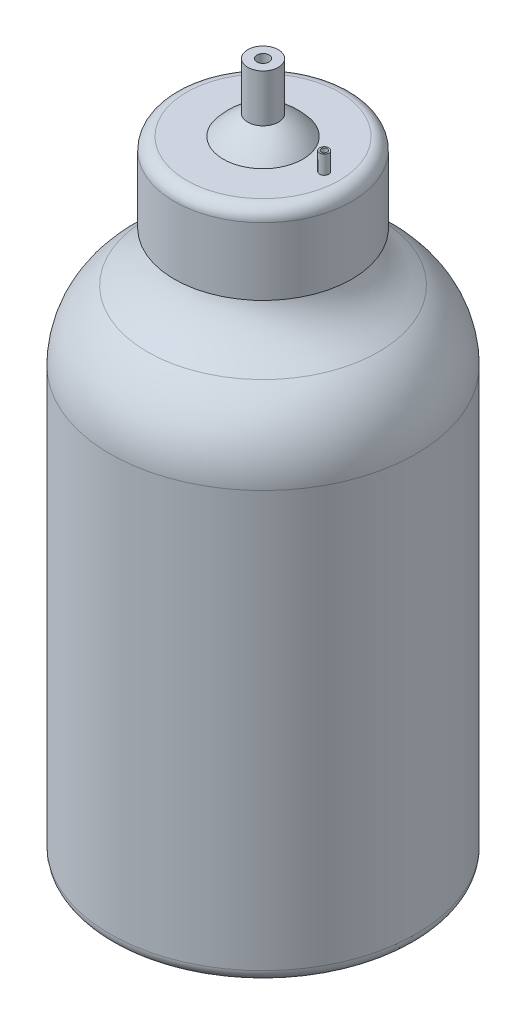
ISO-10303-21;
HEADER;
FILE_DESCRIPTION(('STEP AP214'),'2;1');
FILE_NAME('part.step','',(''),(''),'','','');
FILE_SCHEMA(('AUTOMOTIVE_DESIGN { 1 0 10303 214 1 1 1 1 }'));
ENDSEC;
DATA;
#1=APPLICATION_CONTEXT('core data for automotive mechanical design processes');
#2=APPLICATION_PROTOCOL_DEFINITION('international standard','automotive_design',2000,#1);
#3=PRODUCT_CONTEXT('',#1,'mechanical');
#4=PRODUCT('Part','Part','',(#3));
#5=PRODUCT_RELATED_PRODUCT_CATEGORY('part','',(#4));
#6=PRODUCT_DEFINITION_FORMATION('','',#4);
#7=PRODUCT_DEFINITION_CONTEXT('part definition',#1,'design');
#8=PRODUCT_DEFINITION('design','',#6,#7);
#9=PRODUCT_DEFINITION_SHAPE('','',#8);
#10=(LENGTH_UNIT() NAMED_UNIT(*) SI_UNIT(.MILLI.,.METRE.));
#11=(NAMED_UNIT(*) PLANE_ANGLE_UNIT() SI_UNIT($,.RADIAN.));
#12=(NAMED_UNIT(*) SI_UNIT($,.STERADIAN.) SOLID_ANGLE_UNIT());
#13=UNCERTAINTY_MEASURE_WITH_UNIT(LENGTH_MEASURE(1.E-05),#10,'distance_accuracy_value','');
#14=(GEOMETRIC_REPRESENTATION_CONTEXT(3) GLOBAL_UNCERTAINTY_ASSIGNED_CONTEXT((#13)) GLOBAL_UNIT_ASSIGNED_CONTEXT((#10,
#11,#12)) REPRESENTATION_CONTEXT('',''));
#15=CARTESIAN_POINT('',(0.,0.,0.));
#16=DIRECTION('',(0.,0.,1.));
#17=DIRECTION('',(1.,0.,0.));
#18=AXIS2_PLACEMENT_3D('',#15,#16,#17);
#19=CARTESIAN_POINT('',(-14.5,102.5,0.));
#20=DIRECTION('',(0.,-1.,0.));
#21=DIRECTION('',(1.,0.,0.));
#22=AXIS2_PLACEMENT_3D('',#19,#20,#21);
#23=PLANE('',#22);
#24=CARTESIAN_POINT('',(0.,102.5,0.));
#25=DIRECTION('',(0.,-1.,0.));
#26=DIRECTION('',(1.,0.,0.));
#27=AXIS2_PLACEMENT_3D('',#24,#25,#26);
#28=CIRCLE('',#27,6.5);
#29=CARTESIAN_POINT('',(6.5,102.5,0.));
#30=VERTEX_POINT('',#29);
#31=EDGE_CURVE('E94',#30,#30,#28,.T.);
#32=ORIENTED_EDGE('',*,*,#31,.T.);
#33=EDGE_LOOP('',(#32));
#34=FACE_BOUND('',#33,.T.);
#35=CARTESIAN_POINT('',(0.,102.5,0.));
#36=DIRECTION('',(0.,-1.,0.));
#37=DIRECTION('',(1.,0.,0.));
#38=AXIS2_PLACEMENT_3D('',#35,#36,#37);
#39=CIRCLE('',#38,12.5);
#40=CARTESIAN_POINT('',(12.5,102.5,0.));
#41=VERTEX_POINT('',#40);
#42=EDGE_CURVE('E60',#41,#41,#39,.F.);
#43=ORIENTED_EDGE('',*,*,#42,.T.);
#44=EDGE_LOOP('',(#43));
#45=FACE_BOUND('',#44,.T.);
#46=CARTESIAN_POINT('',(9.99999999999998,102.5,0.));
#47=DIRECTION('',(0.,-1.,0.));
#48=DIRECTION('',(1.,0.,0.));
#49=AXIS2_PLACEMENT_3D('',#46,#47,#48);
#50=CIRCLE('',#49,0.75);
#51=CARTESIAN_POINT('',(10.75,102.5,0.));
#52=VERTEX_POINT('',#51);
#53=EDGE_CURVE('E12',#52,#52,#50,.F.);
#54=ORIENTED_EDGE('',*,*,#53,.F.);
#55=EDGE_LOOP('',(#54));
#56=FACE_BOUND('',#55,.T.);
#57=ADVANCED_FACE('F53',(#34,#45,#56),#23,.F.);
#58=CARTESIAN_POINT('',(-13.,89.5,0.));
#59=DIRECTION('',(0.,1.,0.));
#60=DIRECTION('',(-1.,0.,0.));
#61=AXIS2_PLACEMENT_3D('',#58,#59,#60);
#62=PLANE('',#61);
#63=CARTESIAN_POINT('',(0.,89.5,0.));
#64=DIRECTION('',(0.,-1.,0.));
#65=DIRECTION('',(1.,0.,0.));
#66=AXIS2_PLACEMENT_3D('',#63,#64,#65);
#67=CIRCLE('',#66,13.);
#68=CARTESIAN_POINT('',(13.,89.5,0.));
#69=VERTEX_POINT('',#68);
#70=EDGE_CURVE('E68',#69,#69,#67,.T.);
#71=ORIENTED_EDGE('',*,*,#70,.F.);
#72=EDGE_LOOP('',(#71));
#73=FACE_BOUND('',#72,.T.);
#74=CARTESIAN_POINT('',(0.,89.5,0.));
#75=DIRECTION('',(0.,-1.,0.));
#76=DIRECTION('',(1.,0.,0.));
#77=AXIS2_PLACEMENT_3D('',#74,#75,#76);
#78=CIRCLE('',#77,14.5);
#79=CARTESIAN_POINT('',(14.5,89.5,0.));
#80=VERTEX_POINT('',#79);
#81=EDGE_CURVE('E97',#80,#80,#78,.T.);
#82=ORIENTED_EDGE('',*,*,#81,.T.);
#83=EDGE_LOOP('',(#82));
#84=FACE_BOUND('',#83,.T.);
#85=ADVANCED_FACE('F143',(#73,#84),#62,.F.);
#86=CARTESIAN_POINT('',(0.,100.,0.));
#87=DIRECTION('',(0.,-1.,0.));
#88=DIRECTION('',(1.,0.,0.));
#89=AXIS2_PLACEMENT_3D('',#86,#87,#88);
#90=CYLINDRICAL_SURFACE('',#89,13.);
#91=CARTESIAN_POINT('',(0.,101.,0.));
#92=DIRECTION('',(0.,-1.,0.));
#93=DIRECTION('',(1.,0.,0.));
#94=AXIS2_PLACEMENT_3D('',#91,#92,#93);
#95=CIRCLE('',#94,13.);
#96=CARTESIAN_POINT('',(13.,101.,0.));
#97=VERTEX_POINT('',#96);
#98=EDGE_CURVE('E73',#97,#97,#95,.T.);
#99=ORIENTED_EDGE('',*,*,#98,.F.);
#100=EDGE_LOOP('',(#99));
#101=FACE_BOUND('',#100,.T.);
#102=ORIENTED_EDGE('',*,*,#70,.T.);
#103=EDGE_LOOP('',(#102));
#104=FACE_BOUND('',#103,.T.);
#105=ADVANCED_FACE('F140',(#101,#104),#90,.F.);
#106=CARTESIAN_POINT('',(-13.,101.,0.));
#107=DIRECTION('',(0.,1.,0.));
#108=DIRECTION('',(-1.,0.,0.));
#109=AXIS2_PLACEMENT_3D('',#106,#107,#108);
#110=PLANE('',#109);
#111=CARTESIAN_POINT('',(9.99999999999998,101.,0.));
#112=DIRECTION('',(0.,1.,0.));
#113=DIRECTION('',(-1.,0.,0.));
#114=AXIS2_PLACEMENT_3D('',#111,#112,#113);
#115=CIRCLE('',#114,0.500000000000001);
#116=CARTESIAN_POINT('',(9.49999999999998,101.,0.));
#117=VERTEX_POINT('',#116);
#118=EDGE_CURVE('E100',#117,#117,#115,.T.);
#119=ORIENTED_EDGE('',*,*,#118,.T.);
#120=EDGE_LOOP('',(#119));
#121=FACE_BOUND('',#120,.T.);
#122=CARTESIAN_POINT('',(0.,101.,0.));
#123=DIRECTION('',(0.,-1.,0.));
#124=DIRECTION('',(1.,0.,0.));
#125=AXIS2_PLACEMENT_3D('',#122,#123,#124);
#126=CIRCLE('',#125,2.5);
#127=CARTESIAN_POINT('',(2.50000000000001,101.,0.));
#128=VERTEX_POINT('',#127);
#129=EDGE_CURVE('E76',#128,#128,#126,.T.);
#130=ORIENTED_EDGE('',*,*,#129,.F.);
#131=EDGE_LOOP('',(#130));
#132=FACE_BOUND('',#131,.T.);
#133=ORIENTED_EDGE('',*,*,#98,.T.);
#134=EDGE_LOOP('',(#133));
#135=FACE_BOUND('',#134,.T.);
#136=ADVANCED_FACE('F136',(#121,#132,#135),#110,.F.);
#137=CARTESIAN_POINT('',(0.,100.,0.));
#138=DIRECTION('',(0.,-1.,0.));
#139=DIRECTION('',(1.,0.,0.));
#140=AXIS2_PLACEMENT_3D('',#137,#138,#139);
#141=CYLINDRICAL_SURFACE('',#140,2.50000000000001);
#142=CARTESIAN_POINT('',(0.,11.,0.));
#143=DIRECTION('',(0.,-1.,0.));
#144=DIRECTION('',(1.,0.,0.));
#145=AXIS2_PLACEMENT_3D('',#142,#143,#144);
#146=CIRCLE('',#145,2.50000000000001);
#147=CARTESIAN_POINT('',(2.50000000000003,11.,0.));
#148=VERTEX_POINT('',#147);
#149=EDGE_CURVE('E79',#148,#148,#146,.T.);
#150=ORIENTED_EDGE('',*,*,#149,.F.);
#151=EDGE_LOOP('',(#150));
#152=FACE_BOUND('',#151,.T.);
#153=ORIENTED_EDGE('',*,*,#129,.T.);
#154=EDGE_LOOP('',(#153));
#155=FACE_BOUND('',#154,.T.);
#156=ADVANCED_FACE('F132',(#152,#155),#141,.T.);
#157=CARTESIAN_POINT('',(-0.999999999999989,11.,0.));
#158=DIRECTION('',(0.,1.,0.));
#159=DIRECTION('',(-1.,0.,0.));
#160=AXIS2_PLACEMENT_3D('',#157,#158,#159);
#161=PLANE('',#160);
#162=CARTESIAN_POINT('',(0.,11.,0.));
#163=DIRECTION('',(0.,-1.,0.));
#164=DIRECTION('',(1.,0.,0.));
#165=AXIS2_PLACEMENT_3D('',#162,#163,#164);
#166=CIRCLE('',#165,1.00000000000001);
#167=CARTESIAN_POINT('',(1.00000000000003,11.,0.));
#168=VERTEX_POINT('',#167);
#169=EDGE_CURVE('E82',#168,#168,#166,.T.);
#170=ORIENTED_EDGE('',*,*,#169,.F.);
#171=EDGE_LOOP('',(#170));
#172=FACE_BOUND('',#171,.T.);
#173=ORIENTED_EDGE('',*,*,#149,.T.);
#174=EDGE_LOOP('',(#173));
#175=FACE_BOUND('',#174,.T.);
#176=ADVANCED_FACE('F128',(#172,#175),#161,.F.);
#177=CARTESIAN_POINT('',(0.,100.,0.));
#178=DIRECTION('',(0.,-1.,0.));
#179=DIRECTION('',(1.,0.,0.));
#180=AXIS2_PLACEMENT_3D('',#177,#178,#179);
#181=CYLINDRICAL_SURFACE('',#180,1.);
#182=CARTESIAN_POINT('',(0.,113.521479728859,0.));
#183=DIRECTION('',(0.,-1.,0.));
#184=DIRECTION('',(1.,0.,0.));
#185=AXIS2_PLACEMENT_3D('',#182,#183,#184);
#186=CIRCLE('',#185,1.);
#187=CARTESIAN_POINT('',(1.,113.521479728859,0.));
#188=VERTEX_POINT('',#187);
#189=EDGE_CURVE('E85',#188,#188,#186,.T.);
#190=ORIENTED_EDGE('',*,*,#189,.F.);
#191=EDGE_LOOP('',(#190));
#192=FACE_BOUND('',#191,.T.);
#193=ORIENTED_EDGE('',*,*,#169,.T.);
#194=EDGE_LOOP('',(#193));
#195=FACE_BOUND('',#194,.T.);
#196=ADVANCED_FACE('F124',(#192,#195),#181,.F.);
#197=CARTESIAN_POINT('',(-2.5,113.521479728859,0.));
#198=DIRECTION('',(0.,-1.,0.));
#199=DIRECTION('',(1.,0.,0.));
#200=AXIS2_PLACEMENT_3D('',#197,#198,#199);
#201=PLANE('',#200);
#202=CARTESIAN_POINT('',(0.,113.521479728859,0.));
#203=DIRECTION('',(0.,-1.,0.));
#204=DIRECTION('',(1.,0.,0.));
#205=AXIS2_PLACEMENT_3D('',#202,#203,#204);
#206=CIRCLE('',#205,2.5);
#207=CARTESIAN_POINT('',(2.5,113.521479728859,0.));
#208=VERTEX_POINT('',#207);
#209=EDGE_CURVE('E88',#208,#208,#206,.T.);
#210=ORIENTED_EDGE('',*,*,#209,.F.);
#211=EDGE_LOOP('',(#210));
#212=FACE_BOUND('',#211,.T.);
#213=ORIENTED_EDGE('',*,*,#189,.T.);
#214=EDGE_LOOP('',(#213));
#215=FACE_BOUND('',#214,.T.);
#216=ADVANCED_FACE('F120',(#212,#215),#201,.F.);
#217=CARTESIAN_POINT('',(0.,100.,0.));
#218=DIRECTION('',(0.,-1.,0.));
#219=DIRECTION('',(1.,0.,0.));
#220=AXIS2_PLACEMENT_3D('',#217,#218,#219);
#221=CYLINDRICAL_SURFACE('',#220,2.5);
#222=CARTESIAN_POINT('',(0.,105.743021739387,0.));
#223=DIRECTION('',(0.,-1.,0.));
#224=DIRECTION('',(1.,0.,0.));
#225=AXIS2_PLACEMENT_3D('',#222,#223,#224);
#226=CIRCLE('',#225,2.5);
#227=CARTESIAN_POINT('',(2.50000000000001,105.743021739387,0.));
#228=VERTEX_POINT('',#227);
#229=EDGE_CURVE('E91',#228,#228,#226,.T.);
#230=ORIENTED_EDGE('',*,*,#229,.F.);
#231=EDGE_LOOP('',(#230));
#232=FACE_BOUND('',#231,.T.);
#233=ORIENTED_EDGE('',*,*,#209,.T.);
#234=EDGE_LOOP('',(#233));
#235=FACE_BOUND('',#234,.T.);
#236=ADVANCED_FACE('F115',(#232,#235),#221,.T.);
#237=CARTESIAN_POINT('',(-2.5,105.743021739387,0.));
#238=CARTESIAN_POINT('',(-4.83503708404016,104.54169866995,0.));
#239=CARTESIAN_POINT('',(-6.5,102.5,0.));
#240=B_SPLINE_CURVE_WITH_KNOTS('',2,(#237,#238,#239),.UNSPECIFIED.,.F.,.F.,(3,3),(0.,1.),.UNSPECIFIED.);
#241=CARTESIAN_POINT('',(0.,100.,0.));
#242=DIRECTION('',(0.,-1.,0.));
#243=AXIS1_PLACEMENT('',#241,#242);
#244=SURFACE_OF_REVOLUTION('',#240,#243);
#245=ORIENTED_EDGE('',*,*,#31,.F.);
#246=EDGE_LOOP('',(#245));
#247=FACE_BOUND('',#246,.T.);
#248=ORIENTED_EDGE('',*,*,#229,.T.);
#249=EDGE_LOOP('',(#248));
#250=FACE_BOUND('',#249,.T.);
#251=ADVANCED_FACE('F110',(#247,#250),#244,.T.);
#252=CARTESIAN_POINT('',(0.,100.,0.));
#253=DIRECTION('',(0.,-1.,0.));
#254=DIRECTION('',(1.,0.,0.));
#255=AXIS2_PLACEMENT_3D('',#252,#253,#254);
#256=CYLINDRICAL_SURFACE('',#255,14.5);
#257=CARTESIAN_POINT('',(0.,100.5,0.));
#258=DIRECTION('',(0.,-1.,0.));
#259=DIRECTION('',(1.,0.,0.));
#260=AXIS2_PLACEMENT_3D('',#257,#258,#259);
#261=CIRCLE('',#260,14.5);
#262=CARTESIAN_POINT('',(14.5,100.5,0.));
#263=VERTEX_POINT('',#262);
#264=EDGE_CURVE('E64',#263,#263,#261,.T.);
#265=ORIENTED_EDGE('',*,*,#264,.T.);
#266=EDGE_LOOP('',(#265));
#267=FACE_BOUND('',#266,.T.);
#268=ORIENTED_EDGE('',*,*,#81,.F.);
#269=EDGE_LOOP('',(#268));
#270=FACE_BOUND('',#269,.T.);
#271=ADVANCED_FACE('F114',(#267,#270),#256,.T.);
#272=CARTESIAN_POINT('',(0.,100.5,0.));
#273=DIRECTION('',(0.,-1.,0.));
#274=DIRECTION('',(1.,0.,0.));
#275=AXIS2_PLACEMENT_3D('',#272,#273,#274);
#276=TOROIDAL_SURFACE('',#275,12.5,2.);
#277=ORIENTED_EDGE('',*,*,#42,.F.);
#278=EDGE_LOOP('',(#277));
#279=FACE_BOUND('',#278,.T.);
#280=ORIENTED_EDGE('',*,*,#264,.F.);
#281=EDGE_LOOP('',(#280));
#282=FACE_BOUND('',#281,.T.);
#283=ADVANCED_FACE('F55',(#279,#282),#276,.T.);
#284=CARTESIAN_POINT('',(9.99999999999998,92.5,0.));
#285=DIRECTION('',(0.,1.,0.));
#286=DIRECTION('',(-1.,0.,0.));
#287=AXIS2_PLACEMENT_3D('',#284,#285,#286);
#288=CYLINDRICAL_SURFACE('',#287,0.500000000000001);
#289=ORIENTED_EDGE('',*,*,#118,.F.);
#290=EDGE_LOOP('',(#289));
#291=FACE_BOUND('',#290,.T.);
#292=CARTESIAN_POINT('',(9.99999999999998,105.5,0.));
#293=DIRECTION('',(0.,1.,0.));
#294=DIRECTION('',(0.,0.,1.));
#295=AXIS2_PLACEMENT_3D('',#292,#293,#294);
#296=CIRCLE('',#295,0.500000000000001);
#297=CARTESIAN_POINT('',(9.99999999999998,105.5,0.500000000000001));
#298=VERTEX_POINT('',#297);
#299=EDGE_CURVE('E181',#298,#298,#296,.T.);
#300=ORIENTED_EDGE('',*,*,#299,.T.);
#301=EDGE_LOOP('',(#300));
#302=FACE_BOUND('',#301,.T.);
#303=ADVANCED_FACE('F160',(#291,#302),#288,.F.);
#304=CARTESIAN_POINT('',(9.99999999999998,105.5,0.));
#305=DIRECTION('',(0.,1.,0.));
#306=DIRECTION('',(-1.,0.,0.));
#307=AXIS2_PLACEMENT_3D('',#304,#305,#306);
#308=PLANE('',#307);
#309=CARTESIAN_POINT('',(9.99999999999998,105.5,0.));
#310=DIRECTION('',(0.,1.,0.));
#311=DIRECTION('',(-1.,0.,0.));
#312=AXIS2_PLACEMENT_3D('',#309,#310,#311);
#313=CIRCLE('',#312,0.75);
#314=CARTESIAN_POINT('',(9.24999999999998,105.5,0.));
#315=VERTEX_POINT('',#314);
#316=EDGE_CURVE('E178',#315,#315,#313,.T.);
#317=ORIENTED_EDGE('',*,*,#316,.T.);
#318=EDGE_LOOP('',(#317));
#319=FACE_BOUND('',#318,.T.);
#320=ORIENTED_EDGE('',*,*,#299,.F.);
#321=EDGE_LOOP('',(#320));
#322=FACE_BOUND('',#321,.T.);
#323=ADVANCED_FACE('F165',(#319,#322),#308,.T.);
#324=CARTESIAN_POINT('',(9.99999999999998,105.5,0.));
#325=DIRECTION('',(0.,-1.,0.));
#326=DIRECTION('',(1.,0.,0.));
#327=AXIS2_PLACEMENT_3D('',#324,#325,#326);
#328=CYLINDRICAL_SURFACE('',#327,0.75);
#329=ORIENTED_EDGE('',*,*,#316,.F.);
#330=EDGE_LOOP('',(#329));
#331=FACE_BOUND('',#330,.T.);
#332=ORIENTED_EDGE('',*,*,#53,.T.);
#333=EDGE_LOOP('',(#332));
#334=FACE_BOUND('',#333,.T.);
#335=ADVANCED_FACE('F167',(#331,#334),#328,.T.);
#336=CLOSED_SHELL('',(#57,#85,#105,#136,#156,#176,#196,#216,#236,#251,#271,#283,#303,#323,#335));
#337=MANIFOLD_SOLID_BREP('B2',#336);
#338=CARTESIAN_POINT('',(18.9034008728905,81.4068305680927,0.));
#339=CARTESIAN_POINT('',(17.4311850982051,82.3906727641858,0.));
#340=CARTESIAN_POINT('',(13.8859955911002,84.4587886379625,0.));
#341=CARTESIAN_POINT('',(12.,88.1839374237007,0.));
#342=CARTESIAN_POINT('',(12.,90.,0.));
#343=B_SPLINE_CURVE_WITH_KNOTS('',3,(#338,#339,#340,#341,#342),.UNSPECIFIED.,.F.,.F.,(4,1,4),
(0.,0.348131493987865,0.670614433601117),.UNSPECIFIED.);
#344=CARTESIAN_POINT('',(0.,0.,0.));
#345=DIRECTION('',(0.,-1.,0.));
#346=AXIS1_PLACEMENT('',#344,#345);
#347=SURFACE_OF_REVOLUTION('',#343,#346);
#348=CARTESIAN_POINT('',(0.,90.,0.));
#349=DIRECTION('',(0.,1.,0.));
#350=DIRECTION('',(0.,0.,1.));
#351=AXIS2_PLACEMENT_3D('',#348,#349,#350);
#352=CIRCLE('',#351,12.);
#353=CARTESIAN_POINT('',(0.,90.,12.));
#354=VERTEX_POINT('',#353);
#355=EDGE_CURVE('E472',#354,#354,#352,.T.);
#356=ORIENTED_EDGE('',*,*,#355,.F.);
#357=EDGE_LOOP('',(#356));
#358=FACE_BOUND('',#357,.T.);
#359=CARTESIAN_POINT('',(0.,81.4068305680927,0.));
#360=DIRECTION('',(0.,-1.,0.));
#361=DIRECTION('',(0.,0.,-1.));
#362=AXIS2_PLACEMENT_3D('',#359,#360,#361);
#363=CIRCLE('',#362,18.9034008728905);
#364=CARTESIAN_POINT('',(0.,81.4068305680927,-18.9034008728905));
#365=VERTEX_POINT('',#364);
#366=EDGE_CURVE('E310',#365,#365,#363,.T.);
#367=ORIENTED_EDGE('',*,*,#366,.F.);
#368=EDGE_LOOP('',(#367));
#369=FACE_BOUND('',#368,.T.);
#370=ADVANCED_FACE('F299',(#358,#369),#347,.F.);
#371=CARTESIAN_POINT('',(0.,70.,0.));
#372=DIRECTION('',(0.,-1.,0.));
#373=DIRECTION('',(0.,0.,-1.));
#374=AXIS2_PLACEMENT_3D('',#371,#372,#373);
#375=DEGENERATE_TOROIDAL_SURFACE('',#374,11.2805228752871,13.7194771247129,.T.);
#376=ORIENTED_EDGE('',*,*,#366,.T.);
#377=EDGE_LOOP('',(#376));
#378=FACE_BOUND('',#377,.T.);
#379=CARTESIAN_POINT('',(0.,70.,0.));
#380=DIRECTION('',(0.,-1.,0.));
#381=DIRECTION('',(0.,0.,-1.));
#382=AXIS2_PLACEMENT_3D('',#379,#380,#381);
#383=CIRCLE('',#382,25.);
#384=CARTESIAN_POINT('',(0.,70.,-25.));
#385=VERTEX_POINT('',#384);
#386=EDGE_CURVE('E314',#385,#385,#383,.T.);
#387=ORIENTED_EDGE('',*,*,#386,.F.);
#388=EDGE_LOOP('',(#387));
#389=FACE_BOUND('',#388,.T.);
#390=ADVANCED_FACE('F334',(#378,#389),#375,.T.);
#391=CARTESIAN_POINT('',(0.,0.,0.));
#392=DIRECTION('',(0.,-1.,0.));
#393=DIRECTION('',(0.,0.,-1.));
#394=AXIS2_PLACEMENT_3D('',#391,#392,#393);
#395=CYLINDRICAL_SURFACE('',#394,25.);
#396=CARTESIAN_POINT('',(0.,2.,0.));
#397=DIRECTION('',(0.,-1.,0.));
#398=DIRECTION('',(0.,0.,-1.));
#399=AXIS2_PLACEMENT_3D('',#396,#397,#398);
#400=CIRCLE('',#399,25.);
#401=CARTESIAN_POINT('',(0.,2.,-25.));
#402=VERTEX_POINT('',#401);
#403=EDGE_CURVE('E52',#402,#402,#400,.F.);
#404=ORIENTED_EDGE('',*,*,#403,.T.);
#405=EDGE_LOOP('',(#404));
#406=FACE_BOUND('',#405,.T.);
#407=ORIENTED_EDGE('',*,*,#386,.T.);
#408=EDGE_LOOP('',(#407));
#409=FACE_BOUND('',#408,.T.);
#410=ADVANCED_FACE('F358',(#406,#409),#395,.T.);
#411=CARTESIAN_POINT('',(0.,0.,0.));
#412=DIRECTION('',(0.,-1.,0.));
#413=DIRECTION('',(0.,0.,-1.));
#414=AXIS2_PLACEMENT_3D('',#411,#412,#413);
#415=PLANE('',#414);
#416=CARTESIAN_POINT('',(0.,0.,0.));
#417=DIRECTION('',(0.,-1.,0.));
#418=DIRECTION('',(0.,0.,-1.));
#419=AXIS2_PLACEMENT_3D('',#416,#417,#418);
#420=CIRCLE('',#419,23.);
#421=CARTESIAN_POINT('',(0.,0.,-23.));
#422=VERTEX_POINT('',#421);
#423=EDGE_CURVE('E306',#422,#422,#420,.T.);
#424=ORIENTED_EDGE('',*,*,#423,.T.);
#425=EDGE_LOOP('',(#424));
#426=FACE_BOUND('',#425,.T.);
#427=ADVANCED_FACE('F355',(#426),#415,.T.);
#428=CARTESIAN_POINT('',(0.,2.,0.));
#429=DIRECTION('',(0.,-1.,0.));
#430=DIRECTION('',(0.,0.,-1.));
#431=AXIS2_PLACEMENT_3D('',#428,#429,#430);
#432=TOROIDAL_SURFACE('',#431,23.,2.);
#433=ORIENTED_EDGE('',*,*,#403,.F.);
#434=EDGE_LOOP('',(#433));
#435=FACE_BOUND('',#434,.T.);
#436=ORIENTED_EDGE('',*,*,#423,.F.);
#437=EDGE_LOOP('',(#436));
#438=FACE_BOUND('',#437,.T.);
#439=ADVANCED_FACE('F301',(#435,#438),#432,.T.);
#440=CARTESIAN_POINT('',(0.,100.,0.));
#441=DIRECTION('',(0.,1.,0.));
#442=DIRECTION('',(0.,0.,1.));
#443=AXIS2_PLACEMENT_3D('',#440,#441,#442);
#444=PLANE('',#443);
#445=CARTESIAN_POINT('',(0.,100.,0.));
#446=DIRECTION('',(0.,1.,0.));
#447=DIRECTION('',(0.,0.,1.));
#448=AXIS2_PLACEMENT_3D('',#445,#446,#447);
#449=CIRCLE('',#448,12.);
#450=CARTESIAN_POINT('',(0.,100.,12.));
#451=VERTEX_POINT('',#450);
#452=EDGE_CURVE('E469',#451,#451,#449,.T.);
#453=ORIENTED_EDGE('',*,*,#452,.T.);
#454=EDGE_LOOP('',(#453));
#455=FACE_BOUND('',#454,.T.);
#456=CARTESIAN_POINT('',(0.,100.,0.));
#457=DIRECTION('',(0.,1.,0.));
#458=DIRECTION('',(1.,0.,0.));
#459=AXIS2_PLACEMENT_3D('',#456,#457,#458);
#460=CIRCLE('',#459,11.);
#461=CARTESIAN_POINT('',(11.,100.,0.));
#462=VERTEX_POINT('',#461);
#463=EDGE_CURVE('E484',#462,#462,#460,.T.);
#464=ORIENTED_EDGE('',*,*,#463,.F.);
#465=EDGE_LOOP('',(#464));
#466=FACE_BOUND('',#465,.T.);
#467=ADVANCED_FACE('F385',(#455,#466),#444,.T.);
#468=CARTESIAN_POINT('',(0.,100.,0.));
#469=DIRECTION('',(0.,-1.,0.));
#470=DIRECTION('',(0.,0.,-1.));
#471=AXIS2_PLACEMENT_3D('',#468,#469,#470);
#472=CYLINDRICAL_SURFACE('',#471,12.);
#473=ORIENTED_EDGE('',*,*,#452,.F.);
#474=EDGE_LOOP('',(#473));
#475=FACE_BOUND('',#474,.T.);
#476=ORIENTED_EDGE('',*,*,#355,.T.);
#477=EDGE_LOOP('',(#476));
#478=FACE_BOUND('',#477,.T.);
#479=ADVANCED_FACE('F392',(#475,#478),#472,.T.);
#480=CARTESIAN_POINT('',(0.,100.,0.));
#481=DIRECTION('',(0.,-1.,0.));
#482=DIRECTION('',(0.,0.,-1.));
#483=AXIS2_PLACEMENT_3D('',#480,#481,#482);
#484=CYLINDRICAL_SURFACE('',#483,11.);
#485=ORIENTED_EDGE('',*,*,#463,.T.);
#486=EDGE_LOOP('',(#485));
#487=FACE_BOUND('',#486,.T.);
#488=CARTESIAN_POINT('',(0.,90.,0.));
#489=DIRECTION('',(0.,-1.,0.));
#490=DIRECTION('',(0.,0.,-1.));
#491=AXIS2_PLACEMENT_3D('',#488,#489,#490);
#492=CIRCLE('',#491,11.);
#493=CARTESIAN_POINT('',(0.,90.,-11.));
#494=VERTEX_POINT('',#493);
#495=EDGE_CURVE('E324',#494,#494,#492,.T.);
#496=ORIENTED_EDGE('',*,*,#495,.T.);
#497=EDGE_LOOP('',(#496));
#498=FACE_BOUND('',#497,.T.);
#499=ADVANCED_FACE('F350',(#487,#498),#484,.F.);
#500=CARTESIAN_POINT('',(0.,1.,0.));
#501=DIRECTION('',(0.,-1.,0.));
#502=DIRECTION('',(0.,0.,-1.));
#503=AXIS2_PLACEMENT_3D('',#500,#501,#502);
#504=PLANE('',#503);
#505=CARTESIAN_POINT('',(0.,1.,0.));
#506=DIRECTION('',(0.,-1.,0.));
#507=DIRECTION('',(0.,0.,-1.));
#508=AXIS2_PLACEMENT_3D('',#505,#506,#507);
#509=CIRCLE('',#508,23.);
#510=CARTESIAN_POINT('',(0.,1.,-23.));
#511=VERTEX_POINT('',#510);
#512=EDGE_CURVE('E467',#511,#511,#509,.T.);
#513=ORIENTED_EDGE('',*,*,#512,.F.);
#514=EDGE_LOOP('',(#513));
#515=FACE_BOUND('',#514,.T.);
#516=ADVANCED_FACE('F347',(#515),#504,.F.);
#517=CARTESIAN_POINT('',(0.,2.,0.));
#518=DIRECTION('',(0.,-1.,0.));
#519=DIRECTION('',(0.,0.,-1.));
#520=AXIS2_PLACEMENT_3D('',#517,#518,#519);
#521=TOROIDAL_SURFACE('',#520,23.,1.);
#522=CARTESIAN_POINT('',(0.,2.,0.));
#523=DIRECTION('',(0.,-1.,0.));
#524=DIRECTION('',(0.,0.,-1.));
#525=AXIS2_PLACEMENT_3D('',#522,#523,#524);
#526=CIRCLE('',#525,24.);
#527=CARTESIAN_POINT('',(0.,2.,-24.));
#528=VERTEX_POINT('',#527);
#529=EDGE_CURVE('E319',#528,#528,#526,.F.);
#530=ORIENTED_EDGE('',*,*,#529,.T.);
#531=EDGE_LOOP('',(#530));
#532=FACE_BOUND('',#531,.T.);
#533=ORIENTED_EDGE('',*,*,#512,.T.);
#534=EDGE_LOOP('',(#533));
#535=FACE_BOUND('',#534,.T.);
#536=ADVANCED_FACE('F345',(#532,#535),#521,.F.);
#537=CARTESIAN_POINT('',(0.,0.,0.));
#538=DIRECTION('',(0.,-1.,0.));
#539=DIRECTION('',(0.,0.,-1.));
#540=AXIS2_PLACEMENT_3D('',#537,#538,#539);
#541=CYLINDRICAL_SURFACE('',#540,24.);
#542=ORIENTED_EDGE('',*,*,#529,.F.);
#543=EDGE_LOOP('',(#542));
#544=FACE_BOUND('',#543,.T.);
#545=CARTESIAN_POINT('',(0.,70.,0.));
#546=DIRECTION('',(0.,-1.,0.));
#547=DIRECTION('',(0.,0.,-1.));
#548=AXIS2_PLACEMENT_3D('',#545,#546,#547);
#549=CIRCLE('',#548,24.);
#550=CARTESIAN_POINT('',(0.,70.,-24.));
#551=VERTEX_POINT('',#550);
#552=EDGE_CURVE('E465',#551,#551,#549,.T.);
#553=ORIENTED_EDGE('',*,*,#552,.F.);
#554=EDGE_LOOP('',(#553));
#555=FACE_BOUND('',#554,.T.);
#556=ADVANCED_FACE('F341',(#544,#555),#541,.F.);
#557=CARTESIAN_POINT('',(0.,70.,0.));
#558=DIRECTION('',(0.,-1.,0.));
#559=DIRECTION('',(0.,0.,-1.));
#560=AXIS2_PLACEMENT_3D('',#557,#558,#559);
#561=DEGENERATE_TOROIDAL_SURFACE('',#560,11.2805228752871,12.7194771247129,.T.);
#562=CARTESIAN_POINT('',(0.,80.5753972368948,0.));
#563=DIRECTION('',(0.,-1.,0.));
#564=DIRECTION('',(0.,0.,-1.));
#565=AXIS2_PLACEMENT_3D('',#562,#563,#564);
#566=CIRCLE('',#565,18.3477763451983);
#567=CARTESIAN_POINT('',(0.,80.5753972368948,-18.3477763451983));
#568=VERTEX_POINT('',#567);
#569=EDGE_CURVE('E464',#568,#568,#566,.T.);
#570=ORIENTED_EDGE('',*,*,#569,.F.);
#571=EDGE_LOOP('',(#570));
#572=FACE_BOUND('',#571,.T.);
#573=ORIENTED_EDGE('',*,*,#552,.T.);
#574=EDGE_LOOP('',(#573));
#575=FACE_BOUND('',#574,.T.);
#576=ADVANCED_FACE('F338',(#572,#575),#561,.F.);
#577=CARTESIAN_POINT('',(18.9034008728905,81.4068305680927,0.));
#578=CARTESIAN_POINT('',(17.4311850982051,82.3906727641858,0.));
#579=CARTESIAN_POINT('',(13.8859955911002,84.4587886379625,0.));
#580=CARTESIAN_POINT('',(12.,88.1839374237007,0.));
#581=CARTESIAN_POINT('',(12.,90.,0.));
#582=B_SPLINE_CURVE_WITH_KNOTS('',3,(#577,#578,#579,#580,#581),.UNSPECIFIED.,.F.,.F.,(4,1,4),
(0.,0.348131493987865,0.670614433601117),.UNSPECIFIED.);
#583=CARTESIAN_POINT('',(0.,0.,0.));
#584=DIRECTION('',(0.,-1.,0.));
#585=AXIS1_PLACEMENT('',#583,#584);
#586=SURFACE_OF_REVOLUTION('',#582,#585);
#587=OFFSET_SURFACE('',#586,1.,.F.);
#588=ORIENTED_EDGE('',*,*,#495,.F.);
#589=EDGE_LOOP('',(#588));
#590=FACE_BOUND('',#589,.T.);
#591=ORIENTED_EDGE('',*,*,#569,.T.);
#592=EDGE_LOOP('',(#591));
#593=FACE_BOUND('',#592,.T.);
#594=ADVANCED_FACE('F336',(#590,#593),#587,.T.);
#595=CLOSED_SHELL('',(#370,#390,#410,#427,#439,#467,#479,#499,#516,#536,#556,#576,#594));
#596=MANIFOLD_SOLID_BREP('B7',#595);
#597=ADVANCED_BREP_SHAPE_REPRESENTATION('',(#18,#337,#596),#14);
#598=SHAPE_DEFINITION_REPRESENTATION(#9,#597);
ENDSEC;
END-ISO-10303-21;
